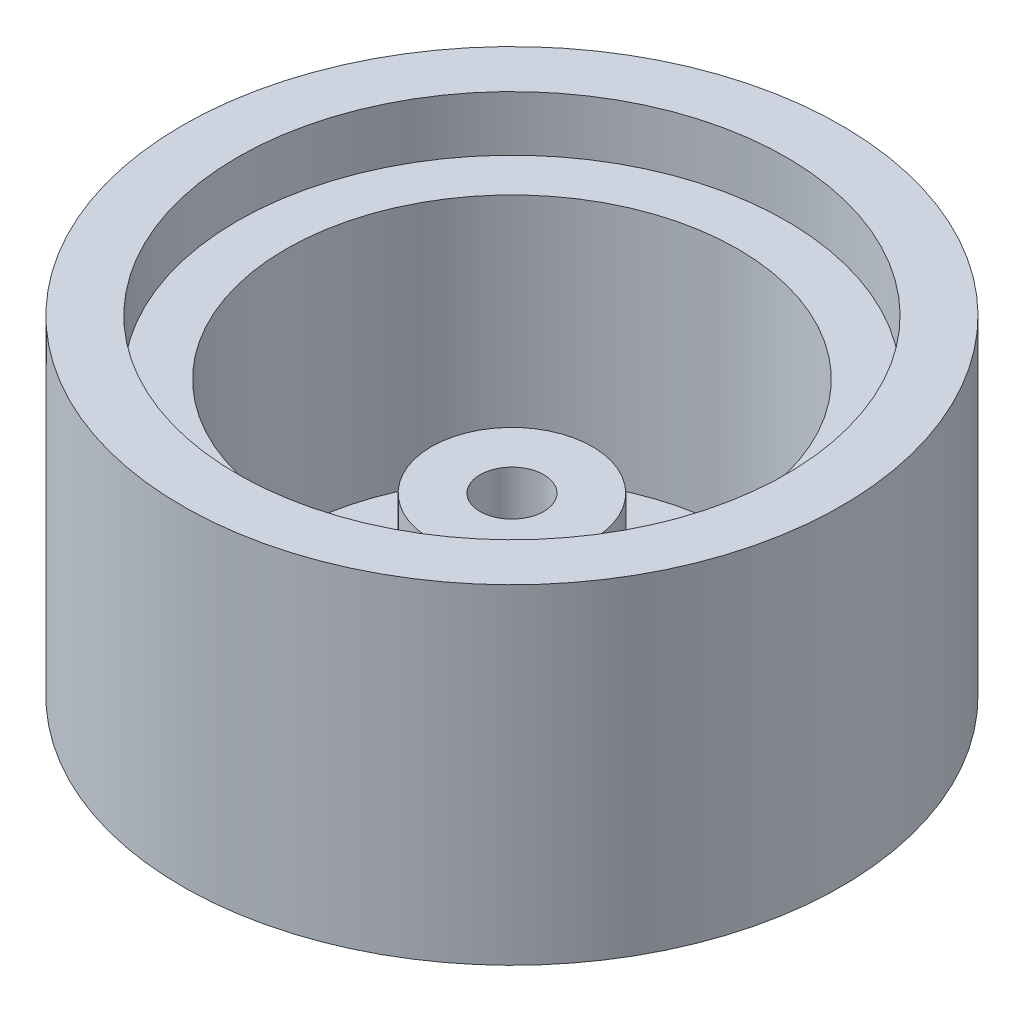
ISO-10303-21;
HEADER;
FILE_DESCRIPTION(('STEP AP214'),'2;1');
FILE_NAME('part.step','',(''),(''),'','','');
FILE_SCHEMA(('AUTOMOTIVE_DESIGN { 1 0 10303 214 1 1 1 1 }'));
ENDSEC;
DATA;
#1=APPLICATION_CONTEXT('core data for automotive mechanical design processes');
#2=APPLICATION_PROTOCOL_DEFINITION('international standard','automotive_design',2000,#1);
#3=PRODUCT_CONTEXT('',#1,'mechanical');
#4=PRODUCT('Part','Part','',(#3));
#5=PRODUCT_RELATED_PRODUCT_CATEGORY('part','',(#4));
#6=PRODUCT_DEFINITION_FORMATION('','',#4);
#7=PRODUCT_DEFINITION_CONTEXT('part definition',#1,'design');
#8=PRODUCT_DEFINITION('design','',#6,#7);
#9=PRODUCT_DEFINITION_SHAPE('','',#8);
#10=(LENGTH_UNIT() NAMED_UNIT(*) SI_UNIT(.MILLI.,.METRE.));
#11=(NAMED_UNIT(*) PLANE_ANGLE_UNIT() SI_UNIT($,.RADIAN.));
#12=(NAMED_UNIT(*) SI_UNIT($,.STERADIAN.) SOLID_ANGLE_UNIT());
#13=UNCERTAINTY_MEASURE_WITH_UNIT(LENGTH_MEASURE(1.E-05),#10,'distance_accuracy_value','');
#14=(GEOMETRIC_REPRESENTATION_CONTEXT(3) GLOBAL_UNCERTAINTY_ASSIGNED_CONTEXT((#13)) GLOBAL_UNIT_ASSIGNED_CONTEXT((#10,
#11,#12)) REPRESENTATION_CONTEXT('',''));
#15=CARTESIAN_POINT('',(0.,0.,0.));
#16=DIRECTION('',(0.,0.,1.));
#17=DIRECTION('',(1.,0.,0.));
#18=AXIS2_PLACEMENT_3D('',#15,#16,#17);
#19=CARTESIAN_POINT('',(0.,55.6945274823875,0.));
#20=DIRECTION('',(0.,1.,0.));
#21=DIRECTION('',(-1.,0.,0.));
#22=AXIS2_PLACEMENT_3D('',#19,#20,#21);
#23=CYLINDRICAL_SURFACE('',#22,2.95);
#24=CARTESIAN_POINT('',(0.,-13.1921209449324,0.));
#25=DIRECTION('',(0.,1.,0.));
#26=DIRECTION('',(-1.,0.,0.));
#27=AXIS2_PLACEMENT_3D('',#24,#25,#26);
#28=CIRCLE('',#27,2.95);
#29=CARTESIAN_POINT('',(-2.94999999999999,-13.1921209449324,0.));
#30=VERTEX_POINT('',#29);
#31=EDGE_CURVE('E10',#30,#30,#28,.T.);
#32=ORIENTED_EDGE('',*,*,#31,.F.);
#33=EDGE_LOOP('',(#32));
#34=FACE_BOUND('',#33,.T.);
#35=CARTESIAN_POINT('',(0.,3.08787905506758,0.));
#36=DIRECTION('',(0.,1.,0.));
#37=DIRECTION('',(-1.,0.,0.));
#38=AXIS2_PLACEMENT_3D('',#35,#36,#37);
#39=CIRCLE('',#38,2.94999999999999);
#40=CARTESIAN_POINT('',(-2.94999999999998,3.08787905506758,0.));
#41=VERTEX_POINT('',#40);
#42=EDGE_CURVE('E66',#41,#41,#39,.T.);
#43=ORIENTED_EDGE('',*,*,#42,.T.);
#44=EDGE_LOOP('',(#43));
#45=FACE_BOUND('',#44,.T.);
#46=ADVANCED_FACE('F32',(#34,#45),#23,.F.);
#47=CARTESIAN_POINT('',(2.95000000000001,-13.1921209449324,0.));
#48=DIRECTION('',(0.,1.,0.));
#49=DIRECTION('',(-1.,0.,0.));
#50=AXIS2_PLACEMENT_3D('',#47,#48,#49);
#51=PLANE('',#50);
#52=CARTESIAN_POINT('',(0.,-13.1921209449324,0.));
#53=DIRECTION('',(0.,1.,0.));
#54=DIRECTION('',(-1.,0.,0.));
#55=AXIS2_PLACEMENT_3D('',#52,#53,#54);
#56=CIRCLE('',#55,30.5);
#57=CARTESIAN_POINT('',(-30.5,-13.1921209449324,0.));
#58=VERTEX_POINT('',#57);
#59=EDGE_CURVE('E38',#58,#58,#56,.T.);
#60=ORIENTED_EDGE('',*,*,#59,.F.);
#61=EDGE_LOOP('',(#60));
#62=FACE_BOUND('',#61,.T.);
#63=ORIENTED_EDGE('',*,*,#31,.T.);
#64=EDGE_LOOP('',(#63));
#65=FACE_BOUND('',#64,.T.);
#66=ADVANCED_FACE('F115',(#62,#65),#51,.F.);
#67=CARTESIAN_POINT('',(0.,55.6945274823875,0.));
#68=DIRECTION('',(0.,1.,0.));
#69=DIRECTION('',(-1.,0.,0.));
#70=AXIS2_PLACEMENT_3D('',#67,#68,#69);
#71=CYLINDRICAL_SURFACE('',#70,30.5);
#72=CARTESIAN_POINT('',(0.,17.3078790550676,0.));
#73=DIRECTION('',(0.,1.,0.));
#74=DIRECTION('',(-1.,0.,0.));
#75=AXIS2_PLACEMENT_3D('',#72,#73,#74);
#76=CIRCLE('',#75,30.5);
#77=CARTESIAN_POINT('',(-30.5,17.3078790550676,0.));
#78=VERTEX_POINT('',#77);
#79=EDGE_CURVE('E42',#78,#78,#76,.T.);
#80=ORIENTED_EDGE('',*,*,#79,.F.);
#81=EDGE_LOOP('',(#80));
#82=FACE_BOUND('',#81,.T.);
#83=ORIENTED_EDGE('',*,*,#59,.T.);
#84=EDGE_LOOP('',(#83));
#85=FACE_BOUND('',#84,.T.);
#86=ADVANCED_FACE('F110',(#82,#85),#71,.T.);
#87=CARTESIAN_POINT('',(30.5,17.3078790550676,0.));
#88=DIRECTION('',(0.,-1.,0.));
#89=DIRECTION('',(1.,0.,0.));
#90=AXIS2_PLACEMENT_3D('',#87,#88,#89);
#91=PLANE('',#90);
#92=CARTESIAN_POINT('',(0.,17.3078790550676,0.));
#93=DIRECTION('',(0.,1.,0.));
#94=DIRECTION('',(-1.,0.,0.));
#95=AXIS2_PLACEMENT_3D('',#92,#93,#94);
#96=CIRCLE('',#95,25.4);
#97=CARTESIAN_POINT('',(-25.4,17.3078790550676,0.));
#98=VERTEX_POINT('',#97);
#99=EDGE_CURVE('E46',#98,#98,#96,.T.);
#100=ORIENTED_EDGE('',*,*,#99,.F.);
#101=EDGE_LOOP('',(#100));
#102=FACE_BOUND('',#101,.T.);
#103=ORIENTED_EDGE('',*,*,#79,.T.);
#104=EDGE_LOOP('',(#103));
#105=FACE_BOUND('',#104,.T.);
#106=ADVANCED_FACE('F104',(#102,#105),#91,.F.);
#107=CARTESIAN_POINT('',(0.,55.6945274823875,0.));
#108=DIRECTION('',(0.,1.,0.));
#109=DIRECTION('',(-1.,0.,0.));
#110=AXIS2_PLACEMENT_3D('',#107,#108,#109);
#111=CYLINDRICAL_SURFACE('',#110,25.4);
#112=CARTESIAN_POINT('',(0.,12.2078790550676,0.));
#113=DIRECTION('',(0.,1.,0.));
#114=DIRECTION('',(-1.,0.,0.));
#115=AXIS2_PLACEMENT_3D('',#112,#113,#114);
#116=CIRCLE('',#115,25.4);
#117=CARTESIAN_POINT('',(-25.4,12.2078790550676,0.));
#118=VERTEX_POINT('',#117);
#119=EDGE_CURVE('E51',#118,#118,#116,.T.);
#120=ORIENTED_EDGE('',*,*,#119,.F.);
#121=EDGE_LOOP('',(#120));
#122=FACE_BOUND('',#121,.T.);
#123=ORIENTED_EDGE('',*,*,#99,.T.);
#124=EDGE_LOOP('',(#123));
#125=FACE_BOUND('',#124,.T.);
#126=ADVANCED_FACE('F98',(#122,#125),#111,.F.);
#127=CARTESIAN_POINT('',(25.4,12.2078790550676,0.));
#128=DIRECTION('',(0.,-1.,0.));
#129=DIRECTION('',(1.,0.,0.));
#130=AXIS2_PLACEMENT_3D('',#127,#128,#129);
#131=PLANE('',#130);
#132=CARTESIAN_POINT('',(0.,12.2078790550676,0.));
#133=DIRECTION('',(0.,1.,0.));
#134=DIRECTION('',(-1.,0.,0.));
#135=AXIS2_PLACEMENT_3D('',#132,#133,#134);
#136=CIRCLE('',#135,20.9);
#137=CARTESIAN_POINT('',(-20.9,12.2078790550676,0.));
#138=VERTEX_POINT('',#137);
#139=EDGE_CURVE('E54',#138,#138,#136,.T.);
#140=ORIENTED_EDGE('',*,*,#139,.F.);
#141=EDGE_LOOP('',(#140));
#142=FACE_BOUND('',#141,.T.);
#143=ORIENTED_EDGE('',*,*,#119,.T.);
#144=EDGE_LOOP('',(#143));
#145=FACE_BOUND('',#144,.T.);
#146=ADVANCED_FACE('F92',(#142,#145),#131,.F.);
#147=CARTESIAN_POINT('',(0.,55.6945274823875,0.));
#148=DIRECTION('',(0.,1.,0.));
#149=DIRECTION('',(-1.,0.,0.));
#150=AXIS2_PLACEMENT_3D('',#147,#148,#149);
#151=CYLINDRICAL_SURFACE('',#150,20.9);
#152=CARTESIAN_POINT('',(0.,-10.5921209449324,0.));
#153=DIRECTION('',(0.,1.,0.));
#154=DIRECTION('',(-1.,0.,0.));
#155=AXIS2_PLACEMENT_3D('',#152,#153,#154);
#156=CIRCLE('',#155,20.9);
#157=CARTESIAN_POINT('',(-20.9,-10.5921209449324,0.));
#158=VERTEX_POINT('',#157);
#159=EDGE_CURVE('E57',#158,#158,#156,.T.);
#160=ORIENTED_EDGE('',*,*,#159,.F.);
#161=EDGE_LOOP('',(#160));
#162=FACE_BOUND('',#161,.T.);
#163=ORIENTED_EDGE('',*,*,#139,.T.);
#164=EDGE_LOOP('',(#163));
#165=FACE_BOUND('',#164,.T.);
#166=ADVANCED_FACE('F86',(#162,#165),#151,.F.);
#167=CARTESIAN_POINT('',(20.9,-10.5921209449324,0.));
#168=DIRECTION('',(0.,-1.,0.));
#169=DIRECTION('',(1.,0.,0.));
#170=AXIS2_PLACEMENT_3D('',#167,#168,#169);
#171=PLANE('',#170);
#172=CARTESIAN_POINT('',(0.,-10.5921209449324,0.));
#173=DIRECTION('',(0.,1.,0.));
#174=DIRECTION('',(-1.,0.,0.));
#175=AXIS2_PLACEMENT_3D('',#172,#173,#174);
#176=CIRCLE('',#175,7.44999999999999);
#177=CARTESIAN_POINT('',(-7.44999999999999,-10.5921209449324,0.));
#178=VERTEX_POINT('',#177);
#179=EDGE_CURVE('E60',#178,#178,#176,.T.);
#180=ORIENTED_EDGE('',*,*,#179,.F.);
#181=EDGE_LOOP('',(#180));
#182=FACE_BOUND('',#181,.T.);
#183=ORIENTED_EDGE('',*,*,#159,.T.);
#184=EDGE_LOOP('',(#183));
#185=FACE_BOUND('',#184,.T.);
#186=ADVANCED_FACE('F80',(#182,#185),#171,.F.);
#187=CARTESIAN_POINT('',(0.,55.6945274823875,0.));
#188=DIRECTION('',(0.,1.,0.));
#189=DIRECTION('',(-1.,0.,0.));
#190=AXIS2_PLACEMENT_3D('',#187,#188,#189);
#191=CYLINDRICAL_SURFACE('',#190,7.44999999999999);
#192=CARTESIAN_POINT('',(0.,3.08787905506759,0.));
#193=DIRECTION('',(0.,1.,0.));
#194=DIRECTION('',(-1.,0.,0.));
#195=AXIS2_PLACEMENT_3D('',#192,#193,#194);
#196=CIRCLE('',#195,7.44999999999999);
#197=CARTESIAN_POINT('',(-7.44999999999999,3.08787905506759,0.));
#198=VERTEX_POINT('',#197);
#199=EDGE_CURVE('E63',#198,#198,#196,.T.);
#200=ORIENTED_EDGE('',*,*,#199,.F.);
#201=EDGE_LOOP('',(#200));
#202=FACE_BOUND('',#201,.T.);
#203=ORIENTED_EDGE('',*,*,#179,.T.);
#204=EDGE_LOOP('',(#203));
#205=FACE_BOUND('',#204,.T.);
#206=ADVANCED_FACE('F74',(#202,#205),#191,.T.);
#207=CARTESIAN_POINT('',(7.45,3.08787905506759,0.));
#208=DIRECTION('',(0.,-1.,0.));
#209=DIRECTION('',(1.,0.,0.));
#210=AXIS2_PLACEMENT_3D('',#207,#208,#209);
#211=PLANE('',#210);
#212=ORIENTED_EDGE('',*,*,#42,.F.);
#213=EDGE_LOOP('',(#212));
#214=FACE_BOUND('',#213,.T.);
#215=ORIENTED_EDGE('',*,*,#199,.T.);
#216=EDGE_LOOP('',(#215));
#217=FACE_BOUND('',#216,.T.);
#218=ADVANCED_FACE('F71',(#214,#217),#211,.F.);
#219=CLOSED_SHELL('',(#46,#66,#86,#106,#126,#146,#166,#186,#206,#218));
#220=MANIFOLD_SOLID_BREP('B2',#219);
#221=ADVANCED_BREP_SHAPE_REPRESENTATION('',(#18,#220),#14);
#222=SHAPE_DEFINITION_REPRESENTATION(#9,#221);
ENDSEC;
END-ISO-10303-21;
